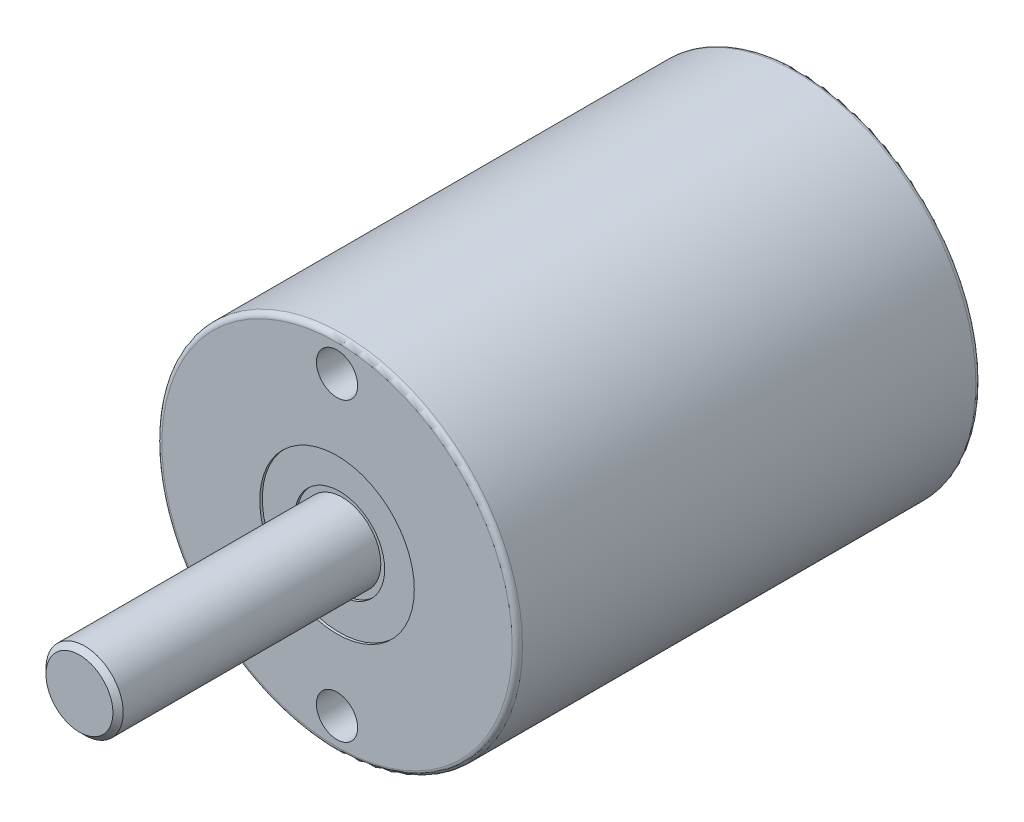
ISO-10303-21;
HEADER;
FILE_DESCRIPTION(('STEP AP214'),'2;1');
FILE_NAME('part.step','',(''),(''),'','','');
FILE_SCHEMA(('AUTOMOTIVE_DESIGN { 1 0 10303 214 1 1 1 1 }'));
ENDSEC;
DATA;
#1=APPLICATION_CONTEXT('core data for automotive mechanical design processes');
#2=APPLICATION_PROTOCOL_DEFINITION('international standard','automotive_design',2000,#1);
#3=PRODUCT_CONTEXT('',#1,'mechanical');
#4=PRODUCT('Part','Part','',(#3));
#5=PRODUCT_RELATED_PRODUCT_CATEGORY('part','',(#4));
#6=PRODUCT_DEFINITION_FORMATION('','',#4);
#7=PRODUCT_DEFINITION_CONTEXT('part definition',#1,'design');
#8=PRODUCT_DEFINITION('design','',#6,#7);
#9=PRODUCT_DEFINITION_SHAPE('','',#8);
#10=(LENGTH_UNIT() NAMED_UNIT(*) SI_UNIT(.MILLI.,.METRE.));
#11=(NAMED_UNIT(*) PLANE_ANGLE_UNIT() SI_UNIT($,.RADIAN.));
#12=(NAMED_UNIT(*) SI_UNIT($,.STERADIAN.) SOLID_ANGLE_UNIT());
#13=UNCERTAINTY_MEASURE_WITH_UNIT(LENGTH_MEASURE(1.E-05),#10,'distance_accuracy_value','');
#14=(GEOMETRIC_REPRESENTATION_CONTEXT(3) GLOBAL_UNCERTAINTY_ASSIGNED_CONTEXT((#13)) GLOBAL_UNIT_ASSIGNED_CONTEXT((#10,
#11,#12)) REPRESENTATION_CONTEXT('',''));
#15=CARTESIAN_POINT('',(0.,0.,0.));
#16=DIRECTION('',(0.,0.,1.));
#17=DIRECTION('',(1.,0.,0.));
#18=AXIS2_PLACEMENT_3D('',#15,#16,#17);
#19=CARTESIAN_POINT('',(0.,0.,18.));
#20=DIRECTION('',(0.,0.,1.));
#21=DIRECTION('',(1.,0.,0.));
#22=AXIS2_PLACEMENT_3D('',#19,#20,#21);
#23=PLANE('',#22);
#24=CARTESIAN_POINT('',(0.,0.,18.));
#25=DIRECTION('',(0.,0.,1.));
#26=DIRECTION('',(1.,0.,0.));
#27=AXIS2_PLACEMENT_3D('',#24,#25,#26);
#28=CIRCLE('',#27,3.);
#29=CARTESIAN_POINT('',(3.,0.,18.));
#30=VERTEX_POINT('',#29);
#31=EDGE_CURVE('E167',#30,#30,#28,.T.);
#32=ORIENTED_EDGE('',*,*,#31,.F.);
#33=EDGE_LOOP('',(#32));
#34=FACE_BOUND('',#33,.T.);
#35=CARTESIAN_POINT('',(0.,5.75,18.));
#36=DIRECTION('',(0.,0.,1.));
#37=DIRECTION('',(1.,0.,0.));
#38=AXIS2_PLACEMENT_3D('',#35,#36,#37);
#39=CIRCLE('',#38,0.799999999999999);
#40=CARTESIAN_POINT('',(0.799999999999999,5.75,18.));
#41=VERTEX_POINT('',#40);
#42=EDGE_CURVE('E63',#41,#41,#39,.T.);
#43=ORIENTED_EDGE('',*,*,#42,.F.);
#44=EDGE_LOOP('',(#43));
#45=FACE_BOUND('',#44,.T.);
#46=CARTESIAN_POINT('',(0.,-5.75,18.));
#47=DIRECTION('',(0.,0.,1.));
#48=DIRECTION('',(1.,0.,0.));
#49=AXIS2_PLACEMENT_3D('',#46,#47,#48);
#50=CIRCLE('',#49,0.799999999999999);
#51=CARTESIAN_POINT('',(0.799999999999999,-5.75,18.));
#52=VERTEX_POINT('',#51);
#53=EDGE_CURVE('E62',#52,#52,#50,.T.);
#54=ORIENTED_EDGE('',*,*,#53,.F.);
#55=EDGE_LOOP('',(#54));
#56=FACE_BOUND('',#55,.T.);
#57=CARTESIAN_POINT('',(0.,0.,18.));
#58=DIRECTION('',(0.,0.,1.));
#59=DIRECTION('',(1.,0.,0.));
#60=AXIS2_PLACEMENT_3D('',#57,#58,#59);
#61=CIRCLE('',#60,6.8);
#62=CARTESIAN_POINT('',(6.8,0.,18.));
#63=VERTEX_POINT('',#62);
#64=EDGE_CURVE('E75',#63,#63,#61,.T.);
#65=ORIENTED_EDGE('',*,*,#64,.T.);
#66=EDGE_LOOP('',(#65));
#67=FACE_BOUND('',#66,.T.);
#68=ADVANCED_FACE('F38',(#34,#45,#56,#67),#23,.T.);
#69=CARTESIAN_POINT('',(0.,0.,18.));
#70=DIRECTION('',(0.,0.,-1.));
#71=DIRECTION('',(-1.,0.,0.));
#72=AXIS2_PLACEMENT_3D('',#69,#70,#71);
#73=CYLINDRICAL_SURFACE('',#72,7.);
#74=CARTESIAN_POINT('',(0.,0.,17.8));
#75=DIRECTION('',(0.,0.,1.));
#76=DIRECTION('',(1.,0.,0.));
#77=AXIS2_PLACEMENT_3D('',#74,#75,#76);
#78=CIRCLE('',#77,7.);
#79=CARTESIAN_POINT('',(7.,0.,17.8));
#80=VERTEX_POINT('',#79);
#81=EDGE_CURVE('E81',#80,#80,#78,.F.);
#82=ORIENTED_EDGE('',*,*,#81,.T.);
#83=EDGE_LOOP('',(#82));
#84=FACE_BOUND('',#83,.T.);
#85=CARTESIAN_POINT('',(0.,0.,0.199999999999999));
#86=DIRECTION('',(0.,0.,1.));
#87=DIRECTION('',(1.,0.,0.));
#88=AXIS2_PLACEMENT_3D('',#85,#86,#87);
#89=CIRCLE('',#88,7.);
#90=CARTESIAN_POINT('',(7.,0.,0.199999999999999));
#91=VERTEX_POINT('',#90);
#92=EDGE_CURVE('E78',#91,#91,#89,.T.);
#93=ORIENTED_EDGE('',*,*,#92,.T.);
#94=EDGE_LOOP('',(#93));
#95=FACE_BOUND('',#94,.T.);
#96=ADVANCED_FACE('F105',(#84,#95),#73,.T.);
#97=CARTESIAN_POINT('',(0.,0.,0.));
#98=DIRECTION('',(0.,0.,1.));
#99=DIRECTION('',(1.,0.,0.));
#100=AXIS2_PLACEMENT_3D('',#97,#98,#99);
#101=PLANE('',#100);
#102=CARTESIAN_POINT('',(0.,0.,0.));
#103=DIRECTION('',(0.,0.,1.));
#104=DIRECTION('',(1.,0.,0.));
#105=AXIS2_PLACEMENT_3D('',#102,#103,#104);
#106=CIRCLE('',#105,6.8);
#107=CARTESIAN_POINT('',(6.8,0.,0.));
#108=VERTEX_POINT('',#107);
#109=EDGE_CURVE('E84',#108,#108,#106,.F.);
#110=ORIENTED_EDGE('',*,*,#109,.T.);
#111=EDGE_LOOP('',(#110));
#112=FACE_BOUND('',#111,.T.);
#113=ADVANCED_FACE('F111',(#112),#101,.F.);
#114=CARTESIAN_POINT('',(0.,0.,17.8));
#115=DIRECTION('',(0.,0.,1.));
#116=DIRECTION('',(1.,0.,0.));
#117=AXIS2_PLACEMENT_3D('',#114,#115,#116);
#118=TOROIDAL_SURFACE('',#117,6.8,0.2);
#119=ORIENTED_EDGE('',*,*,#81,.F.);
#120=EDGE_LOOP('',(#119));
#121=FACE_BOUND('',#120,.T.);
#122=ORIENTED_EDGE('',*,*,#64,.F.);
#123=EDGE_LOOP('',(#122));
#124=FACE_BOUND('',#123,.T.);
#125=ADVANCED_FACE('F118',(#121,#124),#118,.T.);
#126=CARTESIAN_POINT('',(0.,0.,0.199999999999999));
#127=DIRECTION('',(0.,0.,1.));
#128=DIRECTION('',(1.,0.,0.));
#129=AXIS2_PLACEMENT_3D('',#126,#127,#128);
#130=TOROIDAL_SURFACE('',#129,6.8,0.2);
#131=ORIENTED_EDGE('',*,*,#109,.F.);
#132=EDGE_LOOP('',(#131));
#133=FACE_BOUND('',#132,.T.);
#134=ORIENTED_EDGE('',*,*,#92,.F.);
#135=EDGE_LOOP('',(#134));
#136=FACE_BOUND('',#135,.T.);
#137=ADVANCED_FACE('F122',(#133,#136),#130,.T.);
#138=CARTESIAN_POINT('',(0.,-5.75,12.));
#139=DIRECTION('',(0.,0.,1.));
#140=DIRECTION('',(1.,0.,0.));
#141=AXIS2_PLACEMENT_3D('',#138,#139,#140);
#142=CONICAL_SURFACE('',#141,0.799999999999998,1.02974425867665);
#143=CARTESIAN_POINT('',(0.,-5.75,11.5193115047779));
#144=VERTEX_POINT('',#143);
#145=VERTEX_LOOP('',#144);
#146=FACE_BOUND('',#145,.T.);
#147=CARTESIAN_POINT('',(0.,-5.75,12.));
#148=DIRECTION('',(0.,0.,1.));
#149=DIRECTION('',(1.,0.,0.));
#150=AXIS2_PLACEMENT_3D('',#147,#148,#149);
#151=CIRCLE('',#150,0.799999999999998);
#152=CARTESIAN_POINT('',(0.799999999999998,-5.75,12.));
#153=VERTEX_POINT('',#152);
#154=EDGE_CURVE('E66',#153,#153,#151,.T.);
#155=ORIENTED_EDGE('',*,*,#154,.T.);
#156=EDGE_LOOP('',(#155));
#157=FACE_BOUND('',#156,.T.);
#158=ADVANCED_FACE('F125',(#146,#157),#142,.F.);
#159=CARTESIAN_POINT('',(0.,-5.75,18.));
#160=DIRECTION('',(0.,0.,1.));
#161=DIRECTION('',(1.,0.,0.));
#162=AXIS2_PLACEMENT_3D('',#159,#160,#161);
#163=CYLINDRICAL_SURFACE('',#162,0.799999999999999);
#164=ORIENTED_EDGE('',*,*,#154,.F.);
#165=EDGE_LOOP('',(#164));
#166=FACE_BOUND('',#165,.T.);
#167=ORIENTED_EDGE('',*,*,#53,.T.);
#168=EDGE_LOOP('',(#167));
#169=FACE_BOUND('',#168,.T.);
#170=ADVANCED_FACE('F56',(#166,#169),#163,.F.);
#171=CARTESIAN_POINT('',(0.,5.75,12.));
#172=DIRECTION('',(0.,0.,1.));
#173=DIRECTION('',(1.,0.,0.));
#174=AXIS2_PLACEMENT_3D('',#171,#172,#173);
#175=CONICAL_SURFACE('',#174,0.799999999999998,1.02974425867665);
#176=CARTESIAN_POINT('',(0.,5.75,11.5193115047779));
#177=VERTEX_POINT('',#176);
#178=VERTEX_LOOP('',#177);
#179=FACE_BOUND('',#178,.T.);
#180=CARTESIAN_POINT('',(0.,5.75,12.));
#181=DIRECTION('',(0.,0.,1.));
#182=DIRECTION('',(1.,0.,0.));
#183=AXIS2_PLACEMENT_3D('',#180,#181,#182);
#184=CIRCLE('',#183,0.799999999999998);
#185=CARTESIAN_POINT('',(0.799999999999998,5.75,12.));
#186=VERTEX_POINT('',#185);
#187=EDGE_CURVE('E60',#186,#186,#184,.T.);
#188=ORIENTED_EDGE('',*,*,#187,.T.);
#189=EDGE_LOOP('',(#188));
#190=FACE_BOUND('',#189,.T.);
#191=ADVANCED_FACE('F52',(#179,#190),#175,.F.);
#192=CARTESIAN_POINT('',(0.,5.75,18.));
#193=DIRECTION('',(0.,0.,1.));
#194=DIRECTION('',(1.,0.,0.));
#195=AXIS2_PLACEMENT_3D('',#192,#193,#194);
#196=CYLINDRICAL_SURFACE('',#195,0.799999999999999);
#197=ORIENTED_EDGE('',*,*,#187,.F.);
#198=EDGE_LOOP('',(#197));
#199=FACE_BOUND('',#198,.T.);
#200=ORIENTED_EDGE('',*,*,#42,.T.);
#201=EDGE_LOOP('',(#200));
#202=FACE_BOUND('',#201,.T.);
#203=ADVANCED_FACE('F55',(#199,#202),#196,.F.);
#204=CARTESIAN_POINT('',(0.,0.,17.9));
#205=DIRECTION('',(0.,0.,1.));
#206=DIRECTION('',(1.,0.,0.));
#207=AXIS2_PLACEMENT_3D('',#204,#205,#206);
#208=CYLINDRICAL_SURFACE('',#207,3.);
#209=CARTESIAN_POINT('',(0.,0.,17.9));
#210=DIRECTION('',(0.,0.,1.));
#211=DIRECTION('',(1.,0.,0.));
#212=AXIS2_PLACEMENT_3D('',#209,#210,#211);
#213=CIRCLE('',#212,3.);
#214=CARTESIAN_POINT('',(3.,0.,17.9));
#215=VERTEX_POINT('',#214);
#216=EDGE_CURVE('E165',#215,#215,#213,.T.);
#217=ORIENTED_EDGE('',*,*,#216,.F.);
#218=EDGE_LOOP('',(#217));
#219=FACE_BOUND('',#218,.T.);
#220=ORIENTED_EDGE('',*,*,#31,.T.);
#221=EDGE_LOOP('',(#220));
#222=FACE_BOUND('',#221,.T.);
#223=ADVANCED_FACE('F144',(#219,#222),#208,.F.);
#224=CARTESIAN_POINT('',(0.,0.,17.9));
#225=DIRECTION('',(0.,0.,1.));
#226=DIRECTION('',(1.,0.,0.));
#227=AXIS2_PLACEMENT_3D('',#224,#225,#226);
#228=PLANE('',#227);
#229=CARTESIAN_POINT('',(0.,0.,17.9));
#230=DIRECTION('',(0.,0.,1.));
#231=DIRECTION('',(1.,0.,0.));
#232=AXIS2_PLACEMENT_3D('',#229,#230,#231);
#233=CIRCLE('',#232,1.75);
#234=CARTESIAN_POINT('',(1.75,0.,17.9));
#235=VERTEX_POINT('',#234);
#236=EDGE_CURVE('E162',#235,#235,#233,.T.);
#237=ORIENTED_EDGE('',*,*,#236,.F.);
#238=EDGE_LOOP('',(#237));
#239=FACE_BOUND('',#238,.T.);
#240=ORIENTED_EDGE('',*,*,#216,.T.);
#241=EDGE_LOOP('',(#240));
#242=FACE_BOUND('',#241,.T.);
#243=ADVANCED_FACE('F101',(#239,#242),#228,.T.);
#244=CARTESIAN_POINT('',(0.,0.,28.));
#245=DIRECTION('',(0.,0.,1.));
#246=DIRECTION('',(1.,0.,0.));
#247=AXIS2_PLACEMENT_3D('',#244,#245,#246);
#248=PLANE('',#247);
#249=CARTESIAN_POINT('',(0.,0.,28.));
#250=DIRECTION('',(0.,0.,1.));
#251=DIRECTION('',(1.,0.,0.));
#252=AXIS2_PLACEMENT_3D('',#249,#250,#251);
#253=CIRCLE('',#252,1.3);
#254=CARTESIAN_POINT('',(1.3,0.,28.));
#255=VERTEX_POINT('',#254);
#256=EDGE_CURVE('E46',#255,#255,#253,.T.);
#257=ORIENTED_EDGE('',*,*,#256,.T.);
#258=EDGE_LOOP('',(#257));
#259=FACE_BOUND('',#258,.T.);
#260=ADVANCED_FACE('F89',(#259),#248,.T.);
#261=CARTESIAN_POINT('',(0.,0.,28.));
#262=DIRECTION('',(0.,0.,-1.));
#263=DIRECTION('',(-1.,0.,0.));
#264=AXIS2_PLACEMENT_3D('',#261,#262,#263);
#265=CONICAL_SURFACE('',#264,1.3,0.785398163397446);
#266=CARTESIAN_POINT('',(0.,0.,27.8));
#267=DIRECTION('',(0.,0.,1.));
#268=DIRECTION('',(1.,0.,0.));
#269=AXIS2_PLACEMENT_3D('',#266,#267,#268);
#270=CIRCLE('',#269,1.5);
#271=CARTESIAN_POINT('',(1.5,0.,27.8));
#272=VERTEX_POINT('',#271);
#273=EDGE_CURVE('E11',#272,#272,#270,.F.);
#274=ORIENTED_EDGE('',*,*,#273,.F.);
#275=EDGE_LOOP('',(#274));
#276=FACE_BOUND('',#275,.T.);
#277=ORIENTED_EDGE('',*,*,#256,.F.);
#278=EDGE_LOOP('',(#277));
#279=FACE_BOUND('',#278,.T.);
#280=ADVANCED_FACE('F40',(#276,#279),#265,.T.);
#281=CARTESIAN_POINT('',(0.,0.,28.));
#282=DIRECTION('',(0.,0.,-1.));
#283=DIRECTION('',(-1.,0.,0.));
#284=AXIS2_PLACEMENT_3D('',#281,#282,#283);
#285=CYLINDRICAL_SURFACE('',#284,1.5);
#286=ORIENTED_EDGE('',*,*,#273,.T.);
#287=EDGE_LOOP('',(#286));
#288=FACE_BOUND('',#287,.T.);
#289=CARTESIAN_POINT('',(0.,0.,17.8));
#290=DIRECTION('',(0.,0.,1.));
#291=DIRECTION('',(1.,0.,0.));
#292=AXIS2_PLACEMENT_3D('',#289,#290,#291);
#293=CIRCLE('',#292,1.5);
#294=CARTESIAN_POINT('',(1.5,0.,17.8));
#295=VERTEX_POINT('',#294);
#296=EDGE_CURVE('E166',#295,#295,#293,.T.);
#297=ORIENTED_EDGE('',*,*,#296,.T.);
#298=EDGE_LOOP('',(#297));
#299=FACE_BOUND('',#298,.T.);
#300=ADVANCED_FACE('F92',(#288,#299),#285,.T.);
#301=CARTESIAN_POINT('',(0.,0.,17.8));
#302=DIRECTION('',(0.,0.,1.));
#303=DIRECTION('',(1.,0.,0.));
#304=AXIS2_PLACEMENT_3D('',#301,#302,#303);
#305=PLANE('',#304);
#306=ORIENTED_EDGE('',*,*,#296,.F.);
#307=EDGE_LOOP('',(#306));
#308=FACE_BOUND('',#307,.T.);
#309=CARTESIAN_POINT('',(0.,0.,17.8));
#310=DIRECTION('',(0.,0.,1.));
#311=DIRECTION('',(1.,0.,0.));
#312=AXIS2_PLACEMENT_3D('',#309,#310,#311);
#313=CIRCLE('',#312,1.75);
#314=CARTESIAN_POINT('',(1.75,0.,17.8));
#315=VERTEX_POINT('',#314);
#316=EDGE_CURVE('E69',#315,#315,#313,.T.);
#317=ORIENTED_EDGE('',*,*,#316,.T.);
#318=EDGE_LOOP('',(#317));
#319=FACE_BOUND('',#318,.T.);
#320=ADVANCED_FACE('F98',(#308,#319),#305,.T.);
#321=CARTESIAN_POINT('',(0.,0.,17.8));
#322=DIRECTION('',(0.,0.,1.));
#323=DIRECTION('',(1.,0.,0.));
#324=AXIS2_PLACEMENT_3D('',#321,#322,#323);
#325=CYLINDRICAL_SURFACE('',#324,1.75);
#326=ORIENTED_EDGE('',*,*,#316,.F.);
#327=EDGE_LOOP('',(#326));
#328=FACE_BOUND('',#327,.T.);
#329=ORIENTED_EDGE('',*,*,#236,.T.);
#330=EDGE_LOOP('',(#329));
#331=FACE_BOUND('',#330,.T.);
#332=ADVANCED_FACE('F145',(#328,#331),#325,.F.);
#333=CLOSED_SHELL('',(#68,#96,#113,#125,#137,#158,#170,#191,#203,#223,#243,#260,#280,#300,#320,#332));
#334=MANIFOLD_SOLID_BREP('B2',#333);
#335=ADVANCED_BREP_SHAPE_REPRESENTATION('',(#18,#334),#14);
#336=SHAPE_DEFINITION_REPRESENTATION(#9,#335);
ENDSEC;
END-ISO-10303-21;
